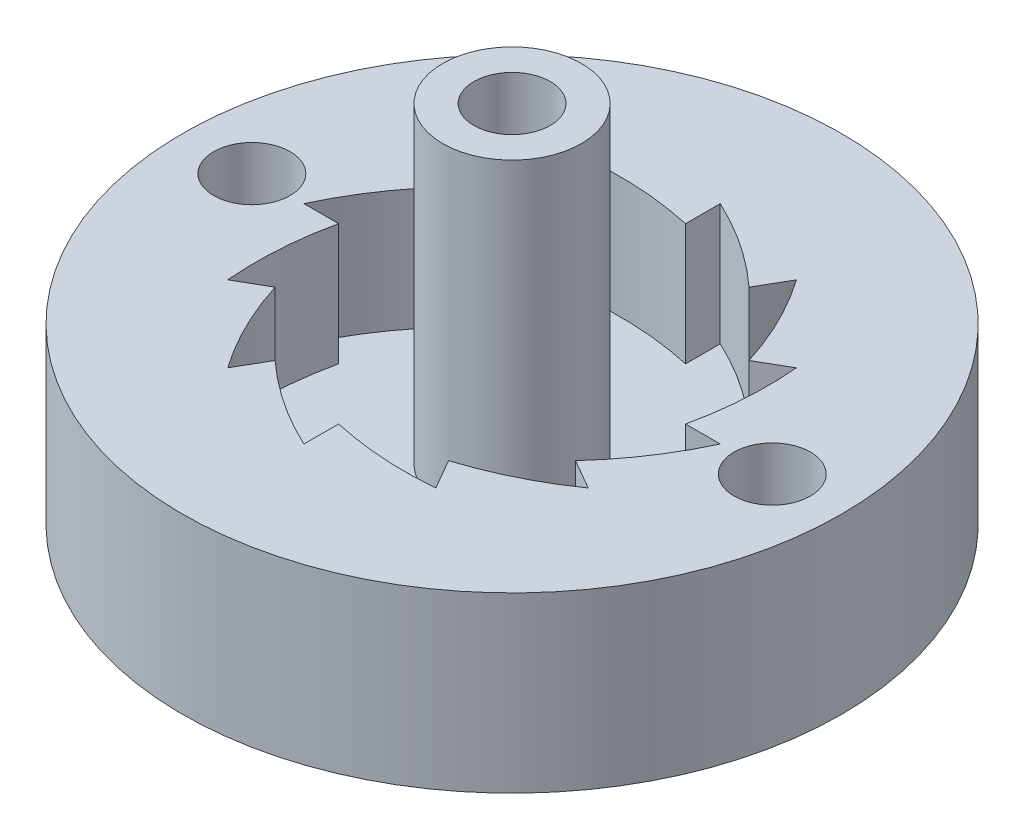
ISO-10303-21;
HEADER;
FILE_DESCRIPTION(('STEP AP214'),'2;1');
FILE_NAME('part.step','',(''),(''),'','','');
FILE_SCHEMA(('AUTOMOTIVE_DESIGN { 1 0 10303 214 1 1 1 1 }'));
ENDSEC;
DATA;
#1=APPLICATION_CONTEXT('core data for automotive mechanical design processes');
#2=APPLICATION_PROTOCOL_DEFINITION('international standard','automotive_design',2000,#1);
#3=PRODUCT_CONTEXT('',#1,'mechanical');
#4=PRODUCT('Part','Part','',(#3));
#5=PRODUCT_RELATED_PRODUCT_CATEGORY('part','',(#4));
#6=PRODUCT_DEFINITION_FORMATION('','',#4);
#7=PRODUCT_DEFINITION_CONTEXT('part definition',#1,'design');
#8=PRODUCT_DEFINITION('design','',#6,#7);
#9=PRODUCT_DEFINITION_SHAPE('','',#8);
#10=(LENGTH_UNIT() NAMED_UNIT(*) SI_UNIT(.MILLI.,.METRE.));
#11=(NAMED_UNIT(*) PLANE_ANGLE_UNIT() SI_UNIT($,.RADIAN.));
#12=(NAMED_UNIT(*) SI_UNIT($,.STERADIAN.) SOLID_ANGLE_UNIT());
#13=UNCERTAINTY_MEASURE_WITH_UNIT(LENGTH_MEASURE(1.E-05),#10,'distance_accuracy_value','');
#14=(GEOMETRIC_REPRESENTATION_CONTEXT(3) GLOBAL_UNCERTAINTY_ASSIGNED_CONTEXT((#13)) GLOBAL_UNIT_ASSIGNED_CONTEXT((#10,
#11,#12)) REPRESENTATION_CONTEXT('',''));
#15=CARTESIAN_POINT('',(0.,0.,0.));
#16=DIRECTION('',(0.,0.,1.));
#17=DIRECTION('',(1.,0.,0.));
#18=AXIS2_PLACEMENT_3D('',#15,#16,#17);
#19=CARTESIAN_POINT('',(0.,1.5,0.));
#20=DIRECTION('',(0.,1.,0.));
#21=DIRECTION('',(0.,0.,1.));
#22=AXIS2_PLACEMENT_3D('',#19,#20,#21);
#23=PLANE('',#22);
#24=CARTESIAN_POINT('',(0.,1.5,0.));
#25=DIRECTION('',(0.,1.,0.));
#26=DIRECTION('',(0.,0.,1.));
#27=AXIS2_PLACEMENT_3D('',#24,#25,#26);
#28=CIRCLE('',#27,2.);
#29=CARTESIAN_POINT('',(0.,1.5,2.));
#30=VERTEX_POINT('',#29);
#31=EDGE_CURVE('E653',#30,#30,#28,.F.);
#32=ORIENTED_EDGE('',*,*,#31,.T.);
#33=EDGE_LOOP('',(#32));
#34=FACE_BOUND('',#33,.T.);
#35=DIRECTION('',(1.,0.,0.));
#36=VECTOR('',#35,1.);
#37=CARTESIAN_POINT('',(0.,1.5,0.));
#38=LINE('',#37,#36);
#39=CARTESIAN_POINT('',(-6.,1.5,-4.71438115369939E-13));
#40=VERTEX_POINT('',#39);
#41=CARTESIAN_POINT('',(-5.,1.5,-3.91257747217735E-13));
#42=VERTEX_POINT('',#41);
#43=EDGE_CURVE('E658',#40,#42,#38,.T.);
#44=ORIENTED_EDGE('',*,*,#43,.T.);
#45=CARTESIAN_POINT('',(4.52402405948389,1.5,2.12913275988392));
#46=DIRECTION('',(0.,1.,0.));
#47=DIRECTION('',(0.,0.,1.));
#48=AXIS2_PLACEMENT_3D('',#45,#46,#47);
#49=CIRCLE('',#48,9.75911064569106);
#50=CARTESIAN_POINT('',(-5.19615242270684,1.5,2.99999999999964));
#51=VERTEX_POINT('',#50);
#52=EDGE_CURVE('E664',#42,#51,#49,.T.);
#53=ORIENTED_EDGE('',*,*,#52,.T.);
#54=DIRECTION('',(0.866025403784474,0.,-0.49999999999994));
#55=VECTOR('',#54,1.);
#56=CARTESIAN_POINT('',(0.,1.5,0.));
#57=LINE('',#56,#55);
#58=CARTESIAN_POINT('',(-4.33012701892237,1.5,2.4999999999997));
#59=VERTEX_POINT('',#58);
#60=EDGE_CURVE('E344',#51,#59,#57,.T.);
#61=ORIENTED_EDGE('',*,*,#60,.T.);
#62=CARTESIAN_POINT('',(4.982486142787,1.5,-0.418128971652845));
#63=DIRECTION('',(0.,1.,0.));
#64=DIRECTION('',(0.,0.,1.));
#65=AXIS2_PLACEMENT_3D('',#62,#63,#64);
#66=CIRCLE('',#65,9.75911064569106);
#67=CARTESIAN_POINT('',(-3.00000000000032,1.5,5.19615242270645));
#68=VERTEX_POINT('',#67);
#69=EDGE_CURVE('E340',#59,#68,#66,.T.);
#70=ORIENTED_EDGE('',*,*,#69,.T.);
#71=DIRECTION('',(0.500000000000053,0.,-0.866025403784408));
#72=VECTOR('',#71,1.);
#73=CARTESIAN_POINT('',(0.,1.5,0.));
#74=LINE('',#73,#72);
#75=CARTESIAN_POINT('',(-2.50000000000026,1.5,4.33012701892204));
#76=VERTEX_POINT('',#75);
#77=EDGE_CURVE('E381',#68,#76,#74,.T.);
#78=ORIENTED_EDGE('',*,*,#77,.T.);
#79=CARTESIAN_POINT('',(4.10589508783104,1.5,-2.85335338290317));
#80=DIRECTION('',(0.,1.,0.));
#81=DIRECTION('',(0.,0.,1.));
#82=AXIS2_PLACEMENT_3D('',#79,#80,#81);
#83=CIRCLE('',#82,9.75911064569106);
#84=CARTESIAN_POINT('',(-3.13680372494356E-13,1.5,6.));
#85=VERTEX_POINT('',#84);
#86=EDGE_CURVE('E375',#76,#85,#83,.T.);
#87=ORIENTED_EDGE('',*,*,#86,.T.);
#88=DIRECTION('',(0.,0.,-1.));
#89=VECTOR('',#88,1.);
#90=CARTESIAN_POINT('',(0.,1.5,0.));
#91=LINE('',#90,#89);
#92=CARTESIAN_POINT('',(-2.61400310411963E-13,1.5,5.));
#93=VERTEX_POINT('',#92);
#94=EDGE_CURVE('E402',#85,#93,#91,.T.);
#95=ORIENTED_EDGE('',*,*,#94,.T.);
#96=CARTESIAN_POINT('',(2.12913275988397,1.5,-4.52402405948396));
#97=DIRECTION('',(0.,1.,0.));
#98=DIRECTION('',(0.,0.,1.));
#99=AXIS2_PLACEMENT_3D('',#96,#97,#98);
#100=CIRCLE('',#99,9.75911064569106);
#101=CARTESIAN_POINT('',(2.99999999999977,1.5,5.19615242270676));
#102=VERTEX_POINT('',#101);
#103=EDGE_CURVE('E396',#93,#102,#100,.T.);
#104=ORIENTED_EDGE('',*,*,#103,.T.);
#105=DIRECTION('',(-0.499999999999962,0.,-0.866025403784461));
#106=VECTOR('',#105,1.);
#107=CARTESIAN_POINT('',(0.,1.5,0.));
#108=LINE('',#107,#106);
#109=CARTESIAN_POINT('',(2.49999999999981,1.5,4.3301270189223));
#110=VERTEX_POINT('',#109);
#111=EDGE_CURVE('E423',#102,#110,#108,.T.);
#112=ORIENTED_EDGE('',*,*,#111,.T.);
#113=CARTESIAN_POINT('',(-0.418128971652975,1.5,-4.98248614278699));
#114=DIRECTION('',(0.,1.,0.));
#115=DIRECTION('',(0.,0.,1.));
#116=AXIS2_PLACEMENT_3D('',#113,#114,#115);
#117=CIRCLE('',#116,9.75911064569106);
#118=CARTESIAN_POINT('',(5.19615242270653,1.5,3.00000000000018));
#119=VERTEX_POINT('',#118);
#120=EDGE_CURVE('E417',#110,#119,#117,.T.);
#121=ORIENTED_EDGE('',*,*,#120,.T.);
#122=DIRECTION('',(-0.866025403784421,0.,-0.50000000000003));
#123=VECTOR('',#122,1.);
#124=CARTESIAN_POINT('',(0.,1.5,0.));
#125=LINE('',#124,#123);
#126=CARTESIAN_POINT('',(4.33012701892211,1.5,2.50000000000015));
#127=VERTEX_POINT('',#126);
#128=EDGE_CURVE('E444',#119,#127,#125,.T.);
#129=ORIENTED_EDGE('',*,*,#128,.T.);
#130=CARTESIAN_POINT('',(-2.85335338290327,1.5,-4.10589508783097));
#131=DIRECTION('',(0.,1.,0.));
#132=DIRECTION('',(0.,0.,1.));
#133=AXIS2_PLACEMENT_3D('',#130,#131,#132);
#134=CIRCLE('',#133,9.75911064569106);
#135=CARTESIAN_POINT('',(6.,1.5,1.55462458598137E-13));
#136=VERTEX_POINT('',#135);
#137=EDGE_CURVE('E438',#127,#136,#134,.T.);
#138=ORIENTED_EDGE('',*,*,#137,.T.);
#139=DIRECTION('',(-1.,0.,0.));
#140=VECTOR('',#139,1.);
#141=CARTESIAN_POINT('',(0.,1.5,0.));
#142=LINE('',#141,#140);
#143=CARTESIAN_POINT('',(5.,1.5,1.29322427556941E-13));
#144=VERTEX_POINT('',#143);
#145=EDGE_CURVE('E465',#136,#144,#142,.T.);
#146=ORIENTED_EDGE('',*,*,#145,.T.);
#147=CARTESIAN_POINT('',(-4.52402405948401,1.5,-2.12913275988377));
#148=DIRECTION('',(0.,1.,0.));
#149=DIRECTION('',(0.,0.,1.));
#150=AXIS2_PLACEMENT_3D('',#147,#148,#149);
#151=CIRCLE('',#150,9.75911064569106);
#152=CARTESIAN_POINT('',(5.19615242270668,1.5,-2.99999999999991));
#153=VERTEX_POINT('',#152);
#154=EDGE_CURVE('E468',#144,#153,#151,.T.);
#155=ORIENTED_EDGE('',*,*,#154,.T.);
#156=DIRECTION('',(-0.866025403784447,0.,0.499999999999985));
#157=VECTOR('',#156,1.);
#158=CARTESIAN_POINT('',(0.,1.5,0.));
#159=LINE('',#158,#157);
#160=CARTESIAN_POINT('',(4.33012701892224,1.5,-2.49999999999993));
#161=VERTEX_POINT('',#160);
#162=EDGE_CURVE('E172',#153,#161,#159,.T.);
#163=ORIENTED_EDGE('',*,*,#162,.T.);
#164=CARTESIAN_POINT('',(-4.98248614278698,1.5,0.418128971653103));
#165=DIRECTION('',(0.,1.,0.));
#166=DIRECTION('',(0.,0.,1.));
#167=AXIS2_PLACEMENT_3D('',#164,#165,#166);
#168=CIRCLE('',#167,9.75911064569106);
#169=CARTESIAN_POINT('',(3.00000000000004,1.5,-5.19615242270661));
#170=VERTEX_POINT('',#169);
#171=EDGE_CURVE('E675',#161,#170,#168,.T.);
#172=ORIENTED_EDGE('',*,*,#171,.T.);
#173=DIRECTION('',(-0.500000000000008,0.,0.866025403784434));
#174=VECTOR('',#173,1.);
#175=CARTESIAN_POINT('',(0.,1.5,0.));
#176=LINE('',#175,#174);
#177=CARTESIAN_POINT('',(2.50000000000004,1.5,-4.33012701892217));
#178=VERTEX_POINT('',#177);
#179=EDGE_CURVE('E178',#170,#178,#176,.T.);
#180=ORIENTED_EDGE('',*,*,#179,.T.);
#181=CARTESIAN_POINT('',(-4.10589508783089,1.5,2.85335338290338));
#182=DIRECTION('',(0.,1.,0.));
#183=DIRECTION('',(0.,0.,1.));
#184=AXIS2_PLACEMENT_3D('',#181,#182,#183);
#185=CIRCLE('',#184,9.75911064569106);
#186=CARTESIAN_POINT('',(0.,1.5,-6.));
#187=VERTEX_POINT('',#186);
#188=EDGE_CURVE('E695',#178,#187,#185,.T.);
#189=ORIENTED_EDGE('',*,*,#188,.T.);
#190=DIRECTION('',(0.,0.,1.));
#191=VECTOR('',#190,1.);
#192=CARTESIAN_POINT('',(0.,1.5,0.));
#193=LINE('',#192,#191);
#194=CARTESIAN_POINT('',(0.,1.5,-5.));
#195=VERTEX_POINT('',#194);
#196=EDGE_CURVE('E720',#187,#195,#193,.T.);
#197=ORIENTED_EDGE('',*,*,#196,.T.);
#198=CARTESIAN_POINT('',(-2.12913275988441,1.5,4.52402405948387));
#199=DIRECTION('',(0.,1.,0.));
#200=DIRECTION('',(0.,0.,1.));
#201=AXIS2_PLACEMENT_3D('',#198,#199,#200);
#202=CIRCLE('',#201,9.75911064569106);
#203=CARTESIAN_POINT('',(-2.9999999999995,1.5,-5.19615242270692));
#204=VERTEX_POINT('',#203);
#205=EDGE_CURVE('E714',#195,#204,#202,.T.);
#206=ORIENTED_EDGE('',*,*,#205,.T.);
#207=DIRECTION('',(0.499999999999917,0.,0.866025403784487));
#208=VECTOR('',#207,1.);
#209=CARTESIAN_POINT('',(0.,1.5,0.));
#210=LINE('',#209,#208);
#211=CARTESIAN_POINT('',(-2.49999999999958,1.5,-4.33012701892244));
#212=VERTEX_POINT('',#211);
#213=EDGE_CURVE('E741',#204,#212,#210,.T.);
#214=ORIENTED_EDGE('',*,*,#213,.T.);
#215=CARTESIAN_POINT('',(0.418128971652716,1.5,4.98248614278701));
#216=DIRECTION('',(0.,1.,0.));
#217=DIRECTION('',(0.,0.,1.));
#218=AXIS2_PLACEMENT_3D('',#215,#216,#217);
#219=CIRCLE('',#218,9.75911064569106);
#220=CARTESIAN_POINT('',(-5.19615242270637,1.5,-3.00000000000045));
#221=VERTEX_POINT('',#220);
#222=EDGE_CURVE('E735',#212,#221,#219,.T.);
#223=ORIENTED_EDGE('',*,*,#222,.T.);
#224=DIRECTION('',(0.866025403784395,0.,0.500000000000075));
#225=VECTOR('',#224,1.);
#226=CARTESIAN_POINT('',(0.,1.5,0.));
#227=LINE('',#226,#225);
#228=CARTESIAN_POINT('',(-4.33012701892198,1.5,-2.50000000000038));
#229=VERTEX_POINT('',#228);
#230=EDGE_CURVE('E353',#221,#229,#227,.T.);
#231=ORIENTED_EDGE('',*,*,#230,.T.);
#232=CARTESIAN_POINT('',(2.85335338290306,1.5,4.10589508783111));
#233=DIRECTION('',(0.,1.,0.));
#234=DIRECTION('',(0.,0.,1.));
#235=AXIS2_PLACEMENT_3D('',#232,#233,#234);
#236=CIRCLE('',#235,9.75911064569106);
#237=EDGE_CURVE('E347',#229,#40,#236,.T.);
#238=ORIENTED_EDGE('',*,*,#237,.T.);
#239=EDGE_LOOP('',(#44,#53,#61,#70,#78,#87,#95,#104,#112,#121,#129,#138,#146,#155,#163,#172,
#180,#189,#197,#206,#214,#223,#231,#238));
#240=FACE_BOUND('',#239,.T.);
#241=ADVANCED_FACE('F155',(#34,#240),#23,.T.);
#242=CARTESIAN_POINT('',(0.,0.,0.));
#243=DIRECTION('',(0.,1.,0.));
#244=DIRECTION('',(-1.,0.,0.));
#245=AXIS2_PLACEMENT_3D('',#242,#243,#244);
#246=PLANE('',#245);
#247=CARTESIAN_POINT('',(0.,0.,0.));
#248=DIRECTION('',(0.,1.,0.));
#249=DIRECTION('',(0.,0.,1.));
#250=AXIS2_PLACEMENT_3D('',#247,#248,#249);
#251=CIRCLE('',#250,4.);
#252=CARTESIAN_POINT('',(0.,0.,4.));
#253=VERTEX_POINT('',#252);
#254=EDGE_CURVE('E644',#253,#253,#251,.T.);
#255=ORIENTED_EDGE('',*,*,#254,.T.);
#256=EDGE_LOOP('',(#255));
#257=FACE_BOUND('',#256,.T.);
#258=CARTESIAN_POINT('',(0.,0.,0.));
#259=DIRECTION('',(0.,-1.,0.));
#260=DIRECTION('',(1.,0.,0.));
#261=AXIS2_PLACEMENT_3D('',#258,#259,#260);
#262=CIRCLE('',#261,9.5);
#263=CARTESIAN_POINT('',(9.5,0.,0.));
#264=VERTEX_POINT('',#263);
#265=EDGE_CURVE('E165',#264,#264,#262,.T.);
#266=ORIENTED_EDGE('',*,*,#265,.T.);
#267=EDGE_LOOP('',(#266));
#268=FACE_BOUND('',#267,.T.);
#269=CARTESIAN_POINT('',(-7.5,0.,0.));
#270=DIRECTION('',(0.,-1.,0.));
#271=DIRECTION('',(0.,0.,-1.));
#272=AXIS2_PLACEMENT_3D('',#269,#270,#271);
#273=CIRCLE('',#272,1.1);
#274=CARTESIAN_POINT('',(-7.5,0.,-1.1));
#275=VERTEX_POINT('',#274);
#276=EDGE_CURVE('E479',#275,#275,#273,.T.);
#277=ORIENTED_EDGE('',*,*,#276,.F.);
#278=EDGE_LOOP('',(#277));
#279=FACE_BOUND('',#278,.T.);
#280=CARTESIAN_POINT('',(7.5,0.,0.));
#281=DIRECTION('',(0.,-1.,0.));
#282=DIRECTION('',(0.,0.,-1.));
#283=AXIS2_PLACEMENT_3D('',#280,#281,#282);
#284=CIRCLE('',#283,1.1);
#285=CARTESIAN_POINT('',(7.5,0.,-1.1));
#286=VERTEX_POINT('',#285);
#287=EDGE_CURVE('E471',#286,#286,#284,.T.);
#288=ORIENTED_EDGE('',*,*,#287,.F.);
#289=EDGE_LOOP('',(#288));
#290=FACE_BOUND('',#289,.T.);
#291=ADVANCED_FACE('F157',(#257,#268,#279,#290),#246,.F.);
#292=CARTESIAN_POINT('',(0.,5.,0.));
#293=DIRECTION('',(0.,1.,0.));
#294=DIRECTION('',(-1.,0.,0.));
#295=AXIS2_PLACEMENT_3D('',#292,#293,#294);
#296=PLANE('',#295);
#297=CARTESIAN_POINT('',(7.5,5.,0.));
#298=DIRECTION('',(0.,1.,0.));
#299=DIRECTION('',(-1.,0.,0.));
#300=AXIS2_PLACEMENT_3D('',#297,#298,#299);
#301=CIRCLE('',#300,1.1);
#302=CARTESIAN_POINT('',(6.4,5.,0.));
#303=VERTEX_POINT('',#302);
#304=EDGE_CURVE('E475',#303,#303,#301,.T.);
#305=ORIENTED_EDGE('',*,*,#304,.F.);
#306=EDGE_LOOP('',(#305));
#307=FACE_BOUND('',#306,.T.);
#308=CARTESIAN_POINT('',(-7.5,5.,0.));
#309=DIRECTION('',(0.,1.,0.));
#310=DIRECTION('',(-1.,0.,0.));
#311=AXIS2_PLACEMENT_3D('',#308,#309,#310);
#312=CIRCLE('',#311,1.1);
#313=CARTESIAN_POINT('',(-8.6,5.,0.));
#314=VERTEX_POINT('',#313);
#315=EDGE_CURVE('E483',#314,#314,#312,.T.);
#316=ORIENTED_EDGE('',*,*,#315,.F.);
#317=EDGE_LOOP('',(#316));
#318=FACE_BOUND('',#317,.T.);
#319=DIRECTION('',(0.500000000000008,0.,-0.866025403784434));
#320=VECTOR('',#319,1.);
#321=CARTESIAN_POINT('',(0.,5.,0.));
#322=LINE('',#321,#320);
#323=CARTESIAN_POINT('',(2.50000000000004,5.,-4.33012701892217));
#324=VERTEX_POINT('',#323);
#325=CARTESIAN_POINT('',(3.00000000000004,5.,-5.19615242270661));
#326=VERTEX_POINT('',#325);
#327=EDGE_CURVE('E692',#324,#326,#322,.T.);
#328=ORIENTED_EDGE('',*,*,#327,.T.);
#329=CARTESIAN_POINT('',(-4.98248614278698,5.,0.418128971653103));
#330=DIRECTION('',(0.,1.,0.));
#331=DIRECTION('',(0.,0.,1.));
#332=AXIS2_PLACEMENT_3D('',#329,#330,#331);
#333=CIRCLE('',#332,9.75911064569106);
#334=CARTESIAN_POINT('',(4.33012701892224,5.,-2.49999999999993));
#335=VERTEX_POINT('',#334);
#336=EDGE_CURVE('E668',#326,#335,#333,.F.);
#337=ORIENTED_EDGE('',*,*,#336,.T.);
#338=DIRECTION('',(0.866025403784447,0.,-0.499999999999985));
#339=VECTOR('',#338,1.);
#340=CARTESIAN_POINT('',(0.,5.,0.));
#341=LINE('',#340,#339);
#342=CARTESIAN_POINT('',(5.19615242270668,5.,-2.99999999999991));
#343=VERTEX_POINT('',#342);
#344=EDGE_CURVE('E671',#335,#343,#341,.T.);
#345=ORIENTED_EDGE('',*,*,#344,.T.);
#346=CARTESIAN_POINT('',(-4.52402405948401,5.,-2.12913275988377));
#347=DIRECTION('',(0.,1.,0.));
#348=DIRECTION('',(0.,0.,1.));
#349=AXIS2_PLACEMENT_3D('',#346,#347,#348);
#350=CIRCLE('',#349,9.75911064569106);
#351=CARTESIAN_POINT('',(5.,5.,1.29322427556941E-13));
#352=VERTEX_POINT('',#351);
#353=EDGE_CURVE('E447',#343,#352,#350,.F.);
#354=ORIENTED_EDGE('',*,*,#353,.T.);
#355=DIRECTION('',(1.,0.,0.));
#356=VECTOR('',#355,1.);
#357=CARTESIAN_POINT('',(0.,5.,0.));
#358=LINE('',#357,#356);
#359=CARTESIAN_POINT('',(6.,5.,1.55462458598137E-13));
#360=VERTEX_POINT('',#359);
#361=EDGE_CURVE('E450',#352,#360,#358,.T.);
#362=ORIENTED_EDGE('',*,*,#361,.T.);
#363=CARTESIAN_POINT('',(-2.85335338290327,5.,-4.10589508783097));
#364=DIRECTION('',(0.,1.,0.));
#365=DIRECTION('',(0.,0.,1.));
#366=AXIS2_PLACEMENT_3D('',#363,#364,#365);
#367=CIRCLE('',#366,9.75911064569106);
#368=CARTESIAN_POINT('',(4.33012701892211,5.,2.50000000000015));
#369=VERTEX_POINT('',#368);
#370=EDGE_CURVE('E431',#360,#369,#367,.F.);
#371=ORIENTED_EDGE('',*,*,#370,.T.);
#372=DIRECTION('',(0.866025403784421,0.,0.50000000000003));
#373=VECTOR('',#372,1.);
#374=CARTESIAN_POINT('',(0.,5.,0.));
#375=LINE('',#374,#373);
#376=CARTESIAN_POINT('',(5.19615242270653,5.,3.00000000000018));
#377=VERTEX_POINT('',#376);
#378=EDGE_CURVE('E435',#369,#377,#375,.T.);
#379=ORIENTED_EDGE('',*,*,#378,.T.);
#380=CARTESIAN_POINT('',(-0.418128971652975,5.,-4.98248614278699));
#381=DIRECTION('',(0.,1.,0.));
#382=DIRECTION('',(0.,0.,1.));
#383=AXIS2_PLACEMENT_3D('',#380,#381,#382);
#384=CIRCLE('',#383,9.75911064569106);
#385=CARTESIAN_POINT('',(2.49999999999981,5.,4.3301270189223));
#386=VERTEX_POINT('',#385);
#387=EDGE_CURVE('E410',#377,#386,#384,.F.);
#388=ORIENTED_EDGE('',*,*,#387,.T.);
#389=DIRECTION('',(0.499999999999962,0.,0.86602540378446));
#390=VECTOR('',#389,1.);
#391=CARTESIAN_POINT('',(0.,5.,0.));
#392=LINE('',#391,#390);
#393=CARTESIAN_POINT('',(2.99999999999977,5.,5.19615242270676));
#394=VERTEX_POINT('',#393);
#395=EDGE_CURVE('E414',#386,#394,#392,.T.);
#396=ORIENTED_EDGE('',*,*,#395,.T.);
#397=CARTESIAN_POINT('',(2.12913275988397,5.,-4.52402405948396));
#398=DIRECTION('',(0.,1.,0.));
#399=DIRECTION('',(0.,0.,1.));
#400=AXIS2_PLACEMENT_3D('',#397,#398,#399);
#401=CIRCLE('',#400,9.75911064569106);
#402=CARTESIAN_POINT('',(-2.61400310411963E-13,5.,5.));
#403=VERTEX_POINT('',#402);
#404=EDGE_CURVE('E389',#394,#403,#401,.F.);
#405=ORIENTED_EDGE('',*,*,#404,.T.);
#406=DIRECTION('',(0.,0.,1.));
#407=VECTOR('',#406,1.);
#408=CARTESIAN_POINT('',(0.,5.,0.));
#409=LINE('',#408,#407);
#410=CARTESIAN_POINT('',(-3.13680372494356E-13,5.,6.));
#411=VERTEX_POINT('',#410);
#412=EDGE_CURVE('E393',#403,#411,#409,.T.);
#413=ORIENTED_EDGE('',*,*,#412,.T.);
#414=CARTESIAN_POINT('',(4.10589508783104,5.,-2.85335338290317));
#415=DIRECTION('',(0.,1.,0.));
#416=DIRECTION('',(0.,0.,1.));
#417=AXIS2_PLACEMENT_3D('',#414,#415,#416);
#418=CIRCLE('',#417,9.75911064569106);
#419=CARTESIAN_POINT('',(-2.50000000000026,5.,4.33012701892204));
#420=VERTEX_POINT('',#419);
#421=EDGE_CURVE('E368',#411,#420,#418,.F.);
#422=ORIENTED_EDGE('',*,*,#421,.T.);
#423=DIRECTION('',(-0.500000000000053,0.,0.866025403784408));
#424=VECTOR('',#423,1.);
#425=CARTESIAN_POINT('',(0.,5.,0.));
#426=LINE('',#425,#424);
#427=CARTESIAN_POINT('',(-3.00000000000032,5.,5.19615242270645));
#428=VERTEX_POINT('',#427);
#429=EDGE_CURVE('E372',#420,#428,#426,.T.);
#430=ORIENTED_EDGE('',*,*,#429,.T.);
#431=CARTESIAN_POINT('',(4.982486142787,5.,-0.418128971652845));
#432=DIRECTION('',(0.,1.,0.));
#433=DIRECTION('',(0.,0.,1.));
#434=AXIS2_PLACEMENT_3D('',#431,#432,#433);
#435=CIRCLE('',#434,9.75911064569106);
#436=CARTESIAN_POINT('',(-4.33012701892237,5.,2.4999999999997));
#437=VERTEX_POINT('',#436);
#438=EDGE_CURVE('E335',#428,#437,#435,.F.);
#439=ORIENTED_EDGE('',*,*,#438,.T.);
#440=DIRECTION('',(-0.866025403784474,0.,0.49999999999994));
#441=VECTOR('',#440,1.);
#442=CARTESIAN_POINT('',(0.,5.,0.));
#443=LINE('',#442,#441);
#444=CARTESIAN_POINT('',(-5.19615242270684,5.,2.99999999999964));
#445=VERTEX_POINT('',#444);
#446=EDGE_CURVE('E331',#437,#445,#443,.T.);
#447=ORIENTED_EDGE('',*,*,#446,.T.);
#448=CARTESIAN_POINT('',(4.52402405948389,5.,2.12913275988392));
#449=DIRECTION('',(0.,1.,0.));
#450=DIRECTION('',(0.,0.,1.));
#451=AXIS2_PLACEMENT_3D('',#448,#449,#450);
#452=CIRCLE('',#451,9.75911064569106);
#453=CARTESIAN_POINT('',(-5.,5.,-3.91257747217735E-13));
#454=VERTEX_POINT('',#453);
#455=EDGE_CURVE('E317',#445,#454,#452,.F.);
#456=ORIENTED_EDGE('',*,*,#455,.T.);
#457=DIRECTION('',(-1.,0.,0.));
#458=VECTOR('',#457,1.);
#459=CARTESIAN_POINT('',(0.,5.,0.));
#460=LINE('',#459,#458);
#461=CARTESIAN_POINT('',(-6.,5.,-4.69233751131474E-13));
#462=VERTEX_POINT('',#461);
#463=EDGE_CURVE('E328',#454,#462,#460,.T.);
#464=ORIENTED_EDGE('',*,*,#463,.T.);
#465=CARTESIAN_POINT('',(2.85335338290306,5.,4.10589508783111));
#466=DIRECTION('',(0.,1.,0.));
#467=DIRECTION('',(0.,0.,1.));
#468=AXIS2_PLACEMENT_3D('',#465,#466,#467);
#469=CIRCLE('',#468,9.75911064569106);
#470=CARTESIAN_POINT('',(-4.33012701892197,5.,-2.50000000000038));
#471=VERTEX_POINT('',#470);
#472=EDGE_CURVE('E744',#462,#471,#469,.F.);
#473=ORIENTED_EDGE('',*,*,#472,.T.);
#474=DIRECTION('',(-0.866025403784395,0.,-0.500000000000075));
#475=VECTOR('',#474,1.);
#476=CARTESIAN_POINT('',(0.,5.,0.));
#477=LINE('',#476,#475);
#478=CARTESIAN_POINT('',(-5.19615242270637,5.,-3.00000000000045));
#479=VERTEX_POINT('',#478);
#480=EDGE_CURVE('E747',#471,#479,#477,.T.);
#481=ORIENTED_EDGE('',*,*,#480,.T.);
#482=CARTESIAN_POINT('',(0.418128971652716,5.,4.98248614278701));
#483=DIRECTION('',(0.,1.,0.));
#484=DIRECTION('',(0.,0.,1.));
#485=AXIS2_PLACEMENT_3D('',#482,#483,#484);
#486=CIRCLE('',#485,9.75911064569106);
#487=CARTESIAN_POINT('',(-2.49999999999958,5.,-4.33012701892244));
#488=VERTEX_POINT('',#487);
#489=EDGE_CURVE('E728',#479,#488,#486,.F.);
#490=ORIENTED_EDGE('',*,*,#489,.T.);
#491=DIRECTION('',(-0.499999999999917,0.,-0.866025403784487));
#492=VECTOR('',#491,1.);
#493=CARTESIAN_POINT('',(0.,5.,0.));
#494=LINE('',#493,#492);
#495=CARTESIAN_POINT('',(-2.9999999999995,5.,-5.19615242270692));
#496=VERTEX_POINT('',#495);
#497=EDGE_CURVE('E732',#488,#496,#494,.T.);
#498=ORIENTED_EDGE('',*,*,#497,.T.);
#499=CARTESIAN_POINT('',(-2.12913275988441,5.,4.52402405948387));
#500=DIRECTION('',(0.,1.,0.));
#501=DIRECTION('',(0.,0.,1.));
#502=AXIS2_PLACEMENT_3D('',#499,#500,#501);
#503=CIRCLE('',#502,9.75911064569106);
#504=CARTESIAN_POINT('',(0.,5.,-5.));
#505=VERTEX_POINT('',#504);
#506=EDGE_CURVE('E707',#496,#505,#503,.F.);
#507=ORIENTED_EDGE('',*,*,#506,.T.);
#508=DIRECTION('',(0.,0.,-1.));
#509=VECTOR('',#508,1.);
#510=CARTESIAN_POINT('',(0.,5.,0.));
#511=LINE('',#510,#509);
#512=CARTESIAN_POINT('',(0.,5.,-6.));
#513=VERTEX_POINT('',#512);
#514=EDGE_CURVE('E711',#505,#513,#511,.T.);
#515=ORIENTED_EDGE('',*,*,#514,.T.);
#516=CARTESIAN_POINT('',(-4.10589508783089,5.,2.85335338290338));
#517=DIRECTION('',(0.,1.,0.));
#518=DIRECTION('',(0.,0.,1.));
#519=AXIS2_PLACEMENT_3D('',#516,#517,#518);
#520=CIRCLE('',#519,9.75911064569106);
#521=EDGE_CURVE('E688',#513,#324,#520,.F.);
#522=ORIENTED_EDGE('',*,*,#521,.T.);
#523=EDGE_LOOP('',(#328,#337,#345,#354,#362,#371,#379,#388,#396,#405,#413,#422,#430,#439,#447,
#456,#464,#473,#481,#490,#498,#507,#515,#522));
#524=FACE_BOUND('',#523,.T.);
#525=CARTESIAN_POINT('',(0.,5.,0.));
#526=DIRECTION('',(0.,-1.,0.));
#527=DIRECTION('',(1.,0.,0.));
#528=AXIS2_PLACEMENT_3D('',#525,#526,#527);
#529=CIRCLE('',#528,9.50000000000001);
#530=CARTESIAN_POINT('',(9.50000000000001,5.,0.));
#531=VERTEX_POINT('',#530);
#532=EDGE_CURVE('E12',#531,#531,#529,.T.);
#533=ORIENTED_EDGE('',*,*,#532,.F.);
#534=EDGE_LOOP('',(#533));
#535=FACE_BOUND('',#534,.T.);
#536=ADVANCED_FACE('F332',(#307,#318,#524,#535),#296,.T.);
#537=CARTESIAN_POINT('',(0.,0.,0.));
#538=DIRECTION('',(0.,-1.,0.));
#539=DIRECTION('',(1.,0.,0.));
#540=AXIS2_PLACEMENT_3D('',#537,#538,#539);
#541=CYLINDRICAL_SURFACE('',#540,9.5);
#542=ORIENTED_EDGE('',*,*,#532,.T.);
#543=EDGE_LOOP('',(#542));
#544=FACE_BOUND('',#543,.T.);
#545=ORIENTED_EDGE('',*,*,#265,.F.);
#546=EDGE_LOOP('',(#545));
#547=FACE_BOUND('',#546,.T.);
#548=ADVANCED_FACE('F493',(#544,#547),#541,.T.);
#549=CARTESIAN_POINT('',(-7.5,0.,0.));
#550=DIRECTION('',(0.,-1.,0.));
#551=DIRECTION('',(0.,0.,-1.));
#552=AXIS2_PLACEMENT_3D('',#549,#550,#551);
#553=CYLINDRICAL_SURFACE('',#552,1.1);
#554=ORIENTED_EDGE('',*,*,#276,.T.);
#555=EDGE_LOOP('',(#554));
#556=FACE_BOUND('',#555,.T.);
#557=ORIENTED_EDGE('',*,*,#315,.T.);
#558=EDGE_LOOP('',(#557));
#559=FACE_BOUND('',#558,.T.);
#560=ADVANCED_FACE('F495',(#556,#559),#553,.F.);
#561=CARTESIAN_POINT('',(7.5,0.,0.));
#562=DIRECTION('',(0.,-1.,0.));
#563=DIRECTION('',(0.,0.,-1.));
#564=AXIS2_PLACEMENT_3D('',#561,#562,#563);
#565=CYLINDRICAL_SURFACE('',#564,1.1);
#566=ORIENTED_EDGE('',*,*,#287,.T.);
#567=EDGE_LOOP('',(#566));
#568=FACE_BOUND('',#567,.T.);
#569=ORIENTED_EDGE('',*,*,#304,.T.);
#570=EDGE_LOOP('',(#569));
#571=FACE_BOUND('',#570,.T.);
#572=ADVANCED_FACE('F501',(#568,#571),#565,.F.);
#573=CARTESIAN_POINT('',(-4.52402405948401,5.,-2.12913275988377));
#574=DIRECTION('',(0.,-1.,0.));
#575=DIRECTION('',(0.,0.,-1.));
#576=AXIS2_PLACEMENT_3D('',#573,#574,#575);
#577=CYLINDRICAL_SURFACE('',#576,9.75911064569106);
#578=ORIENTED_EDGE('',*,*,#154,.F.);
#579=DIRECTION('',(0.,-1.,0.));
#580=VECTOR('',#579,1.);
#581=CARTESIAN_POINT('',(5.,5.,1.29322427556941E-13));
#582=LINE('',#581,#580);
#583=EDGE_CURVE('E457',#352,#144,#582,.T.);
#584=ORIENTED_EDGE('',*,*,#583,.F.);
#585=ORIENTED_EDGE('',*,*,#353,.F.);
#586=DIRECTION('',(0.,-1.,0.));
#587=VECTOR('',#586,1.);
#588=CARTESIAN_POINT('',(5.19615242270668,5.,-2.99999999999991));
#589=LINE('',#588,#587);
#590=EDGE_CURVE('E461',#343,#153,#589,.T.);
#591=ORIENTED_EDGE('',*,*,#590,.T.);
#592=EDGE_LOOP('',(#578,#584,#585,#591));
#593=FACE_BOUND('',#592,.T.);
#594=ADVANCED_FACE('F517',(#593),#577,.F.);
#595=CARTESIAN_POINT('',(0.,5.,0.));
#596=DIRECTION('',(0.,0.,-1.));
#597=DIRECTION('',(-1.,0.,0.));
#598=AXIS2_PLACEMENT_3D('',#595,#596,#597);
#599=PLANE('',#598);
#600=ORIENTED_EDGE('',*,*,#145,.F.);
#601=DIRECTION('',(0.,-1.,0.));
#602=VECTOR('',#601,1.);
#603=CARTESIAN_POINT('',(6.,5.,1.55462458598137E-13));
#604=LINE('',#603,#602);
#605=EDGE_CURVE('E453',#360,#136,#604,.T.);
#606=ORIENTED_EDGE('',*,*,#605,.F.);
#607=ORIENTED_EDGE('',*,*,#361,.F.);
#608=ORIENTED_EDGE('',*,*,#583,.T.);
#609=EDGE_LOOP('',(#600,#606,#607,#608));
#610=FACE_BOUND('',#609,.T.);
#611=ADVANCED_FACE('F521',(#610),#599,.F.);
#612=CARTESIAN_POINT('',(-2.85335338290327,5.,-4.10589508783097));
#613=DIRECTION('',(0.,-1.,0.));
#614=DIRECTION('',(0.,0.,-1.));
#615=AXIS2_PLACEMENT_3D('',#612,#613,#614);
#616=CYLINDRICAL_SURFACE('',#615,9.75911064569106);
#617=ORIENTED_EDGE('',*,*,#137,.F.);
#618=DIRECTION('',(0.,-1.,0.));
#619=VECTOR('',#618,1.);
#620=CARTESIAN_POINT('',(4.33012701892211,5.,2.50000000000015));
#621=LINE('',#620,#619);
#622=EDGE_CURVE('E427',#369,#127,#621,.T.);
#623=ORIENTED_EDGE('',*,*,#622,.F.);
#624=ORIENTED_EDGE('',*,*,#370,.F.);
#625=ORIENTED_EDGE('',*,*,#605,.T.);
#626=EDGE_LOOP('',(#617,#623,#624,#625));
#627=FACE_BOUND('',#626,.T.);
#628=ADVANCED_FACE('F525',(#627),#616,.F.);
#629=CARTESIAN_POINT('',(0.,5.,0.));
#630=DIRECTION('',(0.50000000000003,0.,-0.866025403784421));
#631=DIRECTION('',(-0.866025403784421,0.,-0.50000000000003));
#632=AXIS2_PLACEMENT_3D('',#629,#630,#631);
#633=PLANE('',#632);
#634=ORIENTED_EDGE('',*,*,#128,.F.);
#635=DIRECTION('',(0.,-1.,0.));
#636=VECTOR('',#635,1.);
#637=CARTESIAN_POINT('',(5.19615242270653,5.,3.00000000000018));
#638=LINE('',#637,#636);
#639=EDGE_CURVE('E426',#377,#119,#638,.T.);
#640=ORIENTED_EDGE('',*,*,#639,.F.);
#641=ORIENTED_EDGE('',*,*,#378,.F.);
#642=ORIENTED_EDGE('',*,*,#622,.T.);
#643=EDGE_LOOP('',(#634,#640,#641,#642));
#644=FACE_BOUND('',#643,.T.);
#645=ADVANCED_FACE('F527',(#644),#633,.F.);
#646=CARTESIAN_POINT('',(-0.418128971652975,5.,-4.98248614278699));
#647=DIRECTION('',(0.,-1.,0.));
#648=DIRECTION('',(0.,0.,-1.));
#649=AXIS2_PLACEMENT_3D('',#646,#647,#648);
#650=CYLINDRICAL_SURFACE('',#649,9.75911064569106);
#651=ORIENTED_EDGE('',*,*,#120,.F.);
#652=DIRECTION('',(0.,-1.,0.));
#653=VECTOR('',#652,1.);
#654=CARTESIAN_POINT('',(2.49999999999981,5.,4.3301270189223));
#655=LINE('',#654,#653);
#656=EDGE_CURVE('E406',#386,#110,#655,.T.);
#657=ORIENTED_EDGE('',*,*,#656,.F.);
#658=ORIENTED_EDGE('',*,*,#387,.F.);
#659=ORIENTED_EDGE('',*,*,#639,.T.);
#660=EDGE_LOOP('',(#651,#657,#658,#659));
#661=FACE_BOUND('',#660,.T.);
#662=ADVANCED_FACE('F530',(#661),#650,.F.);
#663=CARTESIAN_POINT('',(0.,5.,0.));
#664=DIRECTION('',(0.866025403784461,0.,-0.499999999999962));
#665=DIRECTION('',(-0.499999999999962,0.,-0.866025403784461));
#666=AXIS2_PLACEMENT_3D('',#663,#664,#665);
#667=PLANE('',#666);
#668=ORIENTED_EDGE('',*,*,#111,.F.);
#669=DIRECTION('',(0.,-1.,0.));
#670=VECTOR('',#669,1.);
#671=CARTESIAN_POINT('',(2.99999999999977,5.,5.19615242270676));
#672=LINE('',#671,#670);
#673=EDGE_CURVE('E405',#394,#102,#672,.T.);
#674=ORIENTED_EDGE('',*,*,#673,.F.);
#675=ORIENTED_EDGE('',*,*,#395,.F.);
#676=ORIENTED_EDGE('',*,*,#656,.T.);
#677=EDGE_LOOP('',(#668,#674,#675,#676));
#678=FACE_BOUND('',#677,.T.);
#679=ADVANCED_FACE('F535',(#678),#667,.F.);
#680=CARTESIAN_POINT('',(2.12913275988397,5.,-4.52402405948396));
#681=DIRECTION('',(0.,-1.,0.));
#682=DIRECTION('',(0.,0.,-1.));
#683=AXIS2_PLACEMENT_3D('',#680,#681,#682);
#684=CYLINDRICAL_SURFACE('',#683,9.75911064569106);
#685=ORIENTED_EDGE('',*,*,#103,.F.);
#686=DIRECTION('',(0.,-1.,0.));
#687=VECTOR('',#686,1.);
#688=CARTESIAN_POINT('',(-2.61400310411963E-13,5.,5.));
#689=LINE('',#688,#687);
#690=EDGE_CURVE('E385',#403,#93,#689,.T.);
#691=ORIENTED_EDGE('',*,*,#690,.F.);
#692=ORIENTED_EDGE('',*,*,#404,.F.);
#693=ORIENTED_EDGE('',*,*,#673,.T.);
#694=EDGE_LOOP('',(#685,#691,#692,#693));
#695=FACE_BOUND('',#694,.T.);
#696=ADVANCED_FACE('F538',(#695),#684,.F.);
#697=CARTESIAN_POINT('',(0.,5.,0.));
#698=DIRECTION('',(1.,0.,0.));
#699=DIRECTION('',(0.,0.,-1.));
#700=AXIS2_PLACEMENT_3D('',#697,#698,#699);
#701=PLANE('',#700);
#702=ORIENTED_EDGE('',*,*,#94,.F.);
#703=DIRECTION('',(0.,-1.,0.));
#704=VECTOR('',#703,1.);
#705=CARTESIAN_POINT('',(-3.13680372494356E-13,5.,6.));
#706=LINE('',#705,#704);
#707=EDGE_CURVE('E384',#411,#85,#706,.T.);
#708=ORIENTED_EDGE('',*,*,#707,.F.);
#709=ORIENTED_EDGE('',*,*,#412,.F.);
#710=ORIENTED_EDGE('',*,*,#690,.T.);
#711=EDGE_LOOP('',(#702,#708,#709,#710));
#712=FACE_BOUND('',#711,.T.);
#713=ADVANCED_FACE('F543',(#712),#701,.F.);
#714=CARTESIAN_POINT('',(4.10589508783104,5.,-2.85335338290317));
#715=DIRECTION('',(0.,-1.,0.));
#716=DIRECTION('',(0.,0.,-1.));
#717=AXIS2_PLACEMENT_3D('',#714,#715,#716);
#718=CYLINDRICAL_SURFACE('',#717,9.75911064569106);
#719=ORIENTED_EDGE('',*,*,#86,.F.);
#720=DIRECTION('',(0.,-1.,0.));
#721=VECTOR('',#720,1.);
#722=CARTESIAN_POINT('',(-2.50000000000026,5.,4.33012701892204));
#723=LINE('',#722,#721);
#724=EDGE_CURVE('E364',#420,#76,#723,.T.);
#725=ORIENTED_EDGE('',*,*,#724,.F.);
#726=ORIENTED_EDGE('',*,*,#421,.F.);
#727=ORIENTED_EDGE('',*,*,#707,.T.);
#728=EDGE_LOOP('',(#719,#725,#726,#727));
#729=FACE_BOUND('',#728,.T.);
#730=ADVANCED_FACE('F546',(#729),#718,.F.);
#731=CARTESIAN_POINT('',(0.,5.,0.));
#732=DIRECTION('',(0.866025403784408,0.,0.500000000000053));
#733=DIRECTION('',(0.500000000000053,0.,-0.866025403784408));
#734=AXIS2_PLACEMENT_3D('',#731,#732,#733);
#735=PLANE('',#734);
#736=ORIENTED_EDGE('',*,*,#77,.F.);
#737=DIRECTION('',(0.,-1.,0.));
#738=VECTOR('',#737,1.);
#739=CARTESIAN_POINT('',(-3.00000000000032,5.,5.19615242270645));
#740=LINE('',#739,#738);
#741=EDGE_CURVE('E363',#428,#68,#740,.T.);
#742=ORIENTED_EDGE('',*,*,#741,.F.);
#743=ORIENTED_EDGE('',*,*,#429,.F.);
#744=ORIENTED_EDGE('',*,*,#724,.T.);
#745=EDGE_LOOP('',(#736,#742,#743,#744));
#746=FACE_BOUND('',#745,.T.);
#747=ADVANCED_FACE('F551',(#746),#735,.F.);
#748=CARTESIAN_POINT('',(4.982486142787,5.,-0.418128971652845));
#749=DIRECTION('',(0.,-1.,0.));
#750=DIRECTION('',(0.,0.,-1.));
#751=AXIS2_PLACEMENT_3D('',#748,#749,#750);
#752=CYLINDRICAL_SURFACE('',#751,9.75911064569106);
#753=ORIENTED_EDGE('',*,*,#69,.F.);
#754=DIRECTION('',(0.,-1.,0.));
#755=VECTOR('',#754,1.);
#756=CARTESIAN_POINT('',(-4.33012701892237,5.,2.4999999999997));
#757=LINE('',#756,#755);
#758=EDGE_CURVE('E346',#437,#59,#757,.T.);
#759=ORIENTED_EDGE('',*,*,#758,.F.);
#760=ORIENTED_EDGE('',*,*,#438,.F.);
#761=ORIENTED_EDGE('',*,*,#741,.T.);
#762=EDGE_LOOP('',(#753,#759,#760,#761));
#763=FACE_BOUND('',#762,.T.);
#764=ADVANCED_FACE('F554',(#763),#752,.F.);
#765=CARTESIAN_POINT('',(0.,5.,0.));
#766=DIRECTION('',(0.49999999999994,0.,0.866025403784474));
#767=DIRECTION('',(0.866025403784474,0.,-0.49999999999994));
#768=AXIS2_PLACEMENT_3D('',#765,#766,#767);
#769=PLANE('',#768);
#770=ORIENTED_EDGE('',*,*,#60,.F.);
#771=DIRECTION('',(0.,-1.,0.));
#772=VECTOR('',#771,1.);
#773=CARTESIAN_POINT('',(-5.19615242270684,5.,2.99999999999964));
#774=LINE('',#773,#772);
#775=EDGE_CURVE('E321',#445,#51,#774,.T.);
#776=ORIENTED_EDGE('',*,*,#775,.F.);
#777=ORIENTED_EDGE('',*,*,#446,.F.);
#778=ORIENTED_EDGE('',*,*,#758,.T.);
#779=EDGE_LOOP('',(#770,#776,#777,#778));
#780=FACE_BOUND('',#779,.T.);
#781=ADVANCED_FACE('F343',(#780),#769,.F.);
#782=CARTESIAN_POINT('',(2.85335338290306,5.,4.10589508783111));
#783=DIRECTION('',(0.,-1.,0.));
#784=DIRECTION('',(0.,0.,-1.));
#785=AXIS2_PLACEMENT_3D('',#782,#783,#784);
#786=CYLINDRICAL_SURFACE('',#785,9.75911064569106);
#787=ORIENTED_EDGE('',*,*,#237,.F.);
#788=DIRECTION('',(0.,-1.,0.));
#789=VECTOR('',#788,1.);
#790=CARTESIAN_POINT('',(-4.33012701892197,5.,-2.50000000000038));
#791=LINE('',#790,#789);
#792=EDGE_CURVE('E754',#471,#229,#791,.T.);
#793=ORIENTED_EDGE('',*,*,#792,.F.);
#794=ORIENTED_EDGE('',*,*,#472,.F.);
#795=DIRECTION('',(0.,-1.,0.));
#796=VECTOR('',#795,1.);
#797=CARTESIAN_POINT('',(-6.,5.,-4.69233751131474E-13));
#798=LINE('',#797,#796);
#799=EDGE_CURVE('E758',#462,#40,#798,.T.);
#800=ORIENTED_EDGE('',*,*,#799,.T.);
#801=EDGE_LOOP('',(#787,#793,#794,#800));
#802=FACE_BOUND('',#801,.T.);
#803=ADVANCED_FACE('F561',(#802),#786,.F.);
#804=CARTESIAN_POINT('',(0.,5.,0.));
#805=DIRECTION('',(-0.500000000000075,0.,0.866025403784395));
#806=DIRECTION('',(0.866025403784395,0.,0.500000000000075));
#807=AXIS2_PLACEMENT_3D('',#804,#805,#806);
#808=PLANE('',#807);
#809=ORIENTED_EDGE('',*,*,#230,.F.);
#810=DIRECTION('',(0.,-1.,0.));
#811=VECTOR('',#810,1.);
#812=CARTESIAN_POINT('',(-5.19615242270637,5.,-3.00000000000045));
#813=LINE('',#812,#811);
#814=EDGE_CURVE('E750',#479,#221,#813,.T.);
#815=ORIENTED_EDGE('',*,*,#814,.F.);
#816=ORIENTED_EDGE('',*,*,#480,.F.);
#817=ORIENTED_EDGE('',*,*,#792,.T.);
#818=EDGE_LOOP('',(#809,#815,#816,#817));
#819=FACE_BOUND('',#818,.T.);
#820=ADVANCED_FACE('F567',(#819),#808,.F.);
#821=CARTESIAN_POINT('',(0.418128971652716,5.,4.98248614278701));
#822=DIRECTION('',(0.,-1.,0.));
#823=DIRECTION('',(0.,0.,-1.));
#824=AXIS2_PLACEMENT_3D('',#821,#822,#823);
#825=CYLINDRICAL_SURFACE('',#824,9.75911064569106);
#826=ORIENTED_EDGE('',*,*,#222,.F.);
#827=DIRECTION('',(0.,-1.,0.));
#828=VECTOR('',#827,1.);
#829=CARTESIAN_POINT('',(-2.49999999999958,5.,-4.33012701892244));
#830=LINE('',#829,#828);
#831=EDGE_CURVE('E724',#488,#212,#830,.T.);
#832=ORIENTED_EDGE('',*,*,#831,.F.);
#833=ORIENTED_EDGE('',*,*,#489,.F.);
#834=ORIENTED_EDGE('',*,*,#814,.T.);
#835=EDGE_LOOP('',(#826,#832,#833,#834));
#836=FACE_BOUND('',#835,.T.);
#837=ADVANCED_FACE('F571',(#836),#825,.F.);
#838=CARTESIAN_POINT('',(0.,5.,0.));
#839=DIRECTION('',(-0.866025403784487,0.,0.499999999999917));
#840=DIRECTION('',(0.499999999999917,0.,0.866025403784487));
#841=AXIS2_PLACEMENT_3D('',#838,#839,#840);
#842=PLANE('',#841);
#843=ORIENTED_EDGE('',*,*,#213,.F.);
#844=DIRECTION('',(0.,-1.,0.));
#845=VECTOR('',#844,1.);
#846=CARTESIAN_POINT('',(-2.9999999999995,5.,-5.19615242270692));
#847=LINE('',#846,#845);
#848=EDGE_CURVE('E723',#496,#204,#847,.T.);
#849=ORIENTED_EDGE('',*,*,#848,.F.);
#850=ORIENTED_EDGE('',*,*,#497,.F.);
#851=ORIENTED_EDGE('',*,*,#831,.T.);
#852=EDGE_LOOP('',(#843,#849,#850,#851));
#853=FACE_BOUND('',#852,.T.);
#854=ADVANCED_FACE('F573',(#853),#842,.F.);
#855=CARTESIAN_POINT('',(-2.12913275988441,5.,4.52402405948387));
#856=DIRECTION('',(0.,-1.,0.));
#857=DIRECTION('',(0.,0.,-1.));
#858=AXIS2_PLACEMENT_3D('',#855,#856,#857);
#859=CYLINDRICAL_SURFACE('',#858,9.75911064569106);
#860=ORIENTED_EDGE('',*,*,#205,.F.);
#861=DIRECTION('',(0.,-1.,0.));
#862=VECTOR('',#861,1.);
#863=CARTESIAN_POINT('',(0.,5.,-5.));
#864=LINE('',#863,#862);
#865=EDGE_CURVE('E703',#505,#195,#864,.T.);
#866=ORIENTED_EDGE('',*,*,#865,.F.);
#867=ORIENTED_EDGE('',*,*,#506,.F.);
#868=ORIENTED_EDGE('',*,*,#848,.T.);
#869=EDGE_LOOP('',(#860,#866,#867,#868));
#870=FACE_BOUND('',#869,.T.);
#871=ADVANCED_FACE('F576',(#870),#859,.F.);
#872=CARTESIAN_POINT('',(0.,5.,0.));
#873=DIRECTION('',(-1.,0.,0.));
#874=DIRECTION('',(0.,0.,1.));
#875=AXIS2_PLACEMENT_3D('',#872,#873,#874);
#876=PLANE('',#875);
#877=ORIENTED_EDGE('',*,*,#196,.F.);
#878=DIRECTION('',(0.,-1.,0.));
#879=VECTOR('',#878,1.);
#880=CARTESIAN_POINT('',(0.,5.,-6.));
#881=LINE('',#880,#879);
#882=EDGE_CURVE('E702',#513,#187,#881,.T.);
#883=ORIENTED_EDGE('',*,*,#882,.F.);
#884=ORIENTED_EDGE('',*,*,#514,.F.);
#885=ORIENTED_EDGE('',*,*,#865,.T.);
#886=EDGE_LOOP('',(#877,#883,#884,#885));
#887=FACE_BOUND('',#886,.T.);
#888=ADVANCED_FACE('F581',(#887),#876,.F.);
#889=CARTESIAN_POINT('',(-4.10589508783089,5.,2.85335338290338));
#890=DIRECTION('',(0.,-1.,0.));
#891=DIRECTION('',(0.,0.,-1.));
#892=AXIS2_PLACEMENT_3D('',#889,#890,#891);
#893=CYLINDRICAL_SURFACE('',#892,9.75911064569106);
#894=ORIENTED_EDGE('',*,*,#188,.F.);
#895=DIRECTION('',(0.,-1.,0.));
#896=VECTOR('',#895,1.);
#897=CARTESIAN_POINT('',(2.50000000000004,5.,-4.33012701892217));
#898=LINE('',#897,#896);
#899=EDGE_CURVE('E684',#324,#178,#898,.T.);
#900=ORIENTED_EDGE('',*,*,#899,.F.);
#901=ORIENTED_EDGE('',*,*,#521,.F.);
#902=ORIENTED_EDGE('',*,*,#882,.T.);
#903=EDGE_LOOP('',(#894,#900,#901,#902));
#904=FACE_BOUND('',#903,.T.);
#905=ADVANCED_FACE('F584',(#904),#893,.F.);
#906=CARTESIAN_POINT('',(0.,5.,0.));
#907=DIRECTION('',(-0.866025403784434,0.,-0.500000000000008));
#908=DIRECTION('',(-0.500000000000008,0.,0.866025403784434));
#909=AXIS2_PLACEMENT_3D('',#906,#907,#908);
#910=PLANE('',#909);
#911=ORIENTED_EDGE('',*,*,#179,.F.);
#912=DIRECTION('',(0.,-1.,0.));
#913=VECTOR('',#912,1.);
#914=CARTESIAN_POINT('',(3.00000000000004,5.,-5.19615242270661));
#915=LINE('',#914,#913);
#916=EDGE_CURVE('E683',#326,#170,#915,.T.);
#917=ORIENTED_EDGE('',*,*,#916,.F.);
#918=ORIENTED_EDGE('',*,*,#327,.F.);
#919=ORIENTED_EDGE('',*,*,#899,.T.);
#920=EDGE_LOOP('',(#911,#917,#918,#919));
#921=FACE_BOUND('',#920,.T.);
#922=ADVANCED_FACE('F589',(#921),#910,.F.);
#923=CARTESIAN_POINT('',(-4.98248614278698,5.,0.418128971653103));
#924=DIRECTION('',(0.,-1.,0.));
#925=DIRECTION('',(0.,0.,-1.));
#926=AXIS2_PLACEMENT_3D('',#923,#924,#925);
#927=CYLINDRICAL_SURFACE('',#926,9.75911064569106);
#928=ORIENTED_EDGE('',*,*,#171,.F.);
#929=DIRECTION('',(0.,-1.,0.));
#930=VECTOR('',#929,1.);
#931=CARTESIAN_POINT('',(4.33012701892224,5.,-2.49999999999993));
#932=LINE('',#931,#930);
#933=EDGE_CURVE('E667',#335,#161,#932,.T.);
#934=ORIENTED_EDGE('',*,*,#933,.F.);
#935=ORIENTED_EDGE('',*,*,#336,.F.);
#936=ORIENTED_EDGE('',*,*,#916,.T.);
#937=EDGE_LOOP('',(#928,#934,#935,#936));
#938=FACE_BOUND('',#937,.T.);
#939=ADVANCED_FACE('F592',(#938),#927,.F.);
#940=CARTESIAN_POINT('',(0.,5.,0.));
#941=DIRECTION('',(-0.499999999999985,0.,-0.866025403784447));
#942=DIRECTION('',(-0.866025403784447,0.,0.499999999999985));
#943=AXIS2_PLACEMENT_3D('',#940,#941,#942);
#944=PLANE('',#943);
#945=ORIENTED_EDGE('',*,*,#162,.F.);
#946=ORIENTED_EDGE('',*,*,#590,.F.);
#947=ORIENTED_EDGE('',*,*,#344,.F.);
#948=ORIENTED_EDGE('',*,*,#933,.T.);
#949=EDGE_LOOP('',(#945,#946,#947,#948));
#950=FACE_BOUND('',#949,.T.);
#951=ADVANCED_FACE('F599',(#950),#944,.F.);
#952=CARTESIAN_POINT('',(4.52402405948389,5.,2.12913275988392));
#953=DIRECTION('',(0.,-1.,0.));
#954=DIRECTION('',(0.,0.,-1.));
#955=AXIS2_PLACEMENT_3D('',#952,#953,#954);
#956=CYLINDRICAL_SURFACE('',#955,9.75911064569106);
#957=ORIENTED_EDGE('',*,*,#52,.F.);
#958=DIRECTION('',(0.,-1.,0.));
#959=VECTOR('',#958,1.);
#960=CARTESIAN_POINT('',(-5.,5.,-3.91257747217735E-13));
#961=LINE('',#960,#959);
#962=EDGE_CURVE('E324',#454,#42,#961,.T.);
#963=ORIENTED_EDGE('',*,*,#962,.F.);
#964=ORIENTED_EDGE('',*,*,#455,.F.);
#965=ORIENTED_EDGE('',*,*,#775,.T.);
#966=EDGE_LOOP('',(#957,#963,#964,#965));
#967=FACE_BOUND('',#966,.T.);
#968=ADVANCED_FACE('F319',(#967),#956,.F.);
#969=CARTESIAN_POINT('',(0.,5.,0.));
#970=DIRECTION('',(0.,0.,1.));
#971=DIRECTION('',(1.,0.,0.));
#972=AXIS2_PLACEMENT_3D('',#969,#970,#971);
#973=PLANE('',#972);
#974=ORIENTED_EDGE('',*,*,#43,.F.);
#975=ORIENTED_EDGE('',*,*,#799,.F.);
#976=ORIENTED_EDGE('',*,*,#463,.F.);
#977=ORIENTED_EDGE('',*,*,#962,.T.);
#978=EDGE_LOOP('',(#974,#975,#976,#977));
#979=FACE_BOUND('',#978,.T.);
#980=ADVANCED_FACE('F606',(#979),#973,.F.);
#981=CARTESIAN_POINT('',(0.,10.5,0.));
#982=DIRECTION('',(0.,-1.,0.));
#983=DIRECTION('',(0.,0.,-1.));
#984=AXIS2_PLACEMENT_3D('',#981,#982,#983);
#985=CYLINDRICAL_SURFACE('',#984,2.);
#986=ORIENTED_EDGE('',*,*,#31,.F.);
#987=EDGE_LOOP('',(#986));
#988=FACE_BOUND('',#987,.T.);
#989=CARTESIAN_POINT('',(0.,10.5,0.));
#990=DIRECTION('',(0.,1.,0.));
#991=DIRECTION('',(0.,0.,1.));
#992=AXIS2_PLACEMENT_3D('',#989,#990,#991);
#993=CIRCLE('',#992,2.);
#994=CARTESIAN_POINT('',(0.,10.5,2.));
#995=VERTEX_POINT('',#994);
#996=EDGE_CURVE('E642',#995,#995,#993,.T.);
#997=ORIENTED_EDGE('',*,*,#996,.F.);
#998=EDGE_LOOP('',(#997));
#999=FACE_BOUND('',#998,.T.);
#1000=ADVANCED_FACE('F609',(#988,#999),#985,.T.);
#1001=CARTESIAN_POINT('',(0.,10.5,0.));
#1002=DIRECTION('',(0.,1.,0.));
#1003=DIRECTION('',(0.,0.,1.));
#1004=AXIS2_PLACEMENT_3D('',#1001,#1002,#1003);
#1005=PLANE('',#1004);
#1006=CARTESIAN_POINT('',(0.,10.5,0.));
#1007=DIRECTION('',(0.,1.,0.));
#1008=DIRECTION('',(0.,0.,1.));
#1009=AXIS2_PLACEMENT_3D('',#1006,#1007,#1008);
#1010=CIRCLE('',#1009,1.1);
#1011=CARTESIAN_POINT('',(0.,10.5,1.1));
#1012=VERTEX_POINT('',#1011);
#1013=EDGE_CURVE('E638',#1012,#1012,#1010,.T.);
#1014=ORIENTED_EDGE('',*,*,#1013,.F.);
#1015=EDGE_LOOP('',(#1014));
#1016=FACE_BOUND('',#1015,.T.);
#1017=ORIENTED_EDGE('',*,*,#996,.T.);
#1018=EDGE_LOOP('',(#1017));
#1019=FACE_BOUND('',#1018,.T.);
#1020=ADVANCED_FACE('F613',(#1016,#1019),#1005,.T.);
#1021=CARTESIAN_POINT('',(0.,10.5,0.));
#1022=DIRECTION('',(0.,1.,0.));
#1023=DIRECTION('',(0.,0.,1.));
#1024=AXIS2_PLACEMENT_3D('',#1021,#1022,#1023);
#1025=CYLINDRICAL_SURFACE('',#1024,1.1);
#1026=CARTESIAN_POINT('',(0.,1.,0.));
#1027=DIRECTION('',(0.,1.,0.));
#1028=DIRECTION('',(0.,0.,1.));
#1029=AXIS2_PLACEMENT_3D('',#1026,#1027,#1028);
#1030=CIRCLE('',#1029,1.1);
#1031=CARTESIAN_POINT('',(0.,1.,1.1));
#1032=VERTEX_POINT('',#1031);
#1033=EDGE_CURVE('E159',#1032,#1032,#1030,.F.);
#1034=ORIENTED_EDGE('',*,*,#1033,.T.);
#1035=EDGE_LOOP('',(#1034));
#1036=FACE_BOUND('',#1035,.T.);
#1037=ORIENTED_EDGE('',*,*,#1013,.T.);
#1038=EDGE_LOOP('',(#1037));
#1039=FACE_BOUND('',#1038,.T.);
#1040=ADVANCED_FACE('F617',(#1036,#1039),#1025,.F.);
#1041=CARTESIAN_POINT('',(0.,1.,0.));
#1042=DIRECTION('',(0.,1.,0.));
#1043=DIRECTION('',(0.,0.,1.));
#1044=AXIS2_PLACEMENT_3D('',#1041,#1042,#1043);
#1045=PLANE('',#1044);
#1046=CARTESIAN_POINT('',(0.,1.,0.));
#1047=DIRECTION('',(0.,1.,0.));
#1048=DIRECTION('',(0.,0.,1.));
#1049=AXIS2_PLACEMENT_3D('',#1046,#1047,#1048);
#1050=CIRCLE('',#1049,4.);
#1051=CARTESIAN_POINT('',(0.,1.,4.));
#1052=VERTEX_POINT('',#1051);
#1053=EDGE_CURVE('E634',#1052,#1052,#1050,.T.);
#1054=ORIENTED_EDGE('',*,*,#1053,.F.);
#1055=EDGE_LOOP('',(#1054));
#1056=FACE_BOUND('',#1055,.T.);
#1057=ORIENTED_EDGE('',*,*,#1033,.F.);
#1058=EDGE_LOOP('',(#1057));
#1059=FACE_BOUND('',#1058,.T.);
#1060=ADVANCED_FACE('F621',(#1056,#1059),#1045,.F.);
#1061=CARTESIAN_POINT('',(0.,1.,0.));
#1062=DIRECTION('',(0.,-1.,0.));
#1063=DIRECTION('',(0.,0.,-1.));
#1064=AXIS2_PLACEMENT_3D('',#1061,#1062,#1063);
#1065=CYLINDRICAL_SURFACE('',#1064,4.);
#1066=ORIENTED_EDGE('',*,*,#1053,.T.);
#1067=EDGE_LOOP('',(#1066));
#1068=FACE_BOUND('',#1067,.T.);
#1069=ORIENTED_EDGE('',*,*,#254,.F.);
#1070=EDGE_LOOP('',(#1069));
#1071=FACE_BOUND('',#1070,.T.);
#1072=ADVANCED_FACE('F623',(#1068,#1071),#1065,.F.);
#1073=CLOSED_SHELL('',(#241,#291,#536,#548,#560,#572,#594,#611,#628,#645,#662,#679,#696,#713,
#730,#747,#764,#781,#803,#820,#837,#854,#871,#888,#905,#922,#939,#951,#968,#980,#1000,#1020,
#1040,#1060,#1072));
#1074=MANIFOLD_SOLID_BREP('B2',#1073);
#1075=ADVANCED_BREP_SHAPE_REPRESENTATION('',(#18,#1074),#14);
#1076=SHAPE_DEFINITION_REPRESENTATION(#9,#1075);
ENDSEC;
END-ISO-10303-21;
